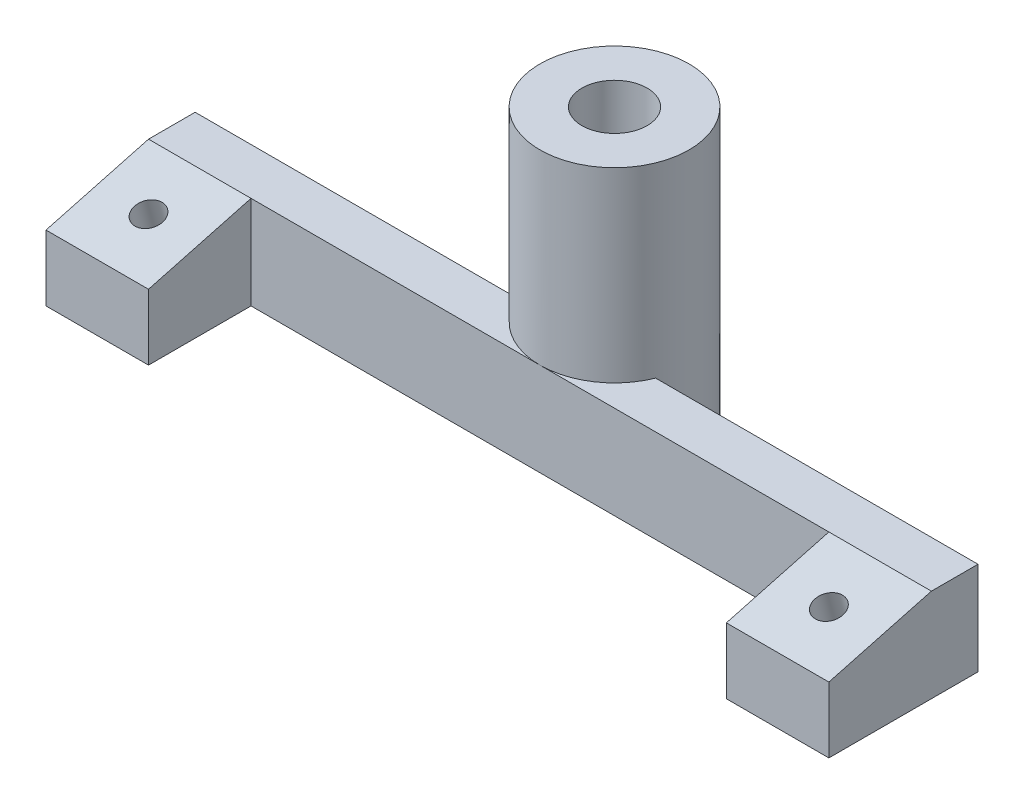
ISO-10303-21;
HEADER;
FILE_DESCRIPTION(('STEP AP214'),'2;1');
FILE_NAME('part.step','',(''),(''),'','','');
FILE_SCHEMA(('AUTOMOTIVE_DESIGN { 1 0 10303 214 1 1 1 1 }'));
ENDSEC;
DATA;
#1=APPLICATION_CONTEXT('core data for automotive mechanical design processes');
#2=APPLICATION_PROTOCOL_DEFINITION('international standard','automotive_design',2000,#1);
#3=PRODUCT_CONTEXT('',#1,'mechanical');
#4=PRODUCT('Part','Part','',(#3));
#5=PRODUCT_RELATED_PRODUCT_CATEGORY('part','',(#4));
#6=PRODUCT_DEFINITION_FORMATION('','',#4);
#7=PRODUCT_DEFINITION_CONTEXT('part definition',#1,'design');
#8=PRODUCT_DEFINITION('design','',#6,#7);
#9=PRODUCT_DEFINITION_SHAPE('','',#8);
#10=(LENGTH_UNIT() NAMED_UNIT(*) SI_UNIT(.MILLI.,.METRE.));
#11=(NAMED_UNIT(*) PLANE_ANGLE_UNIT() SI_UNIT($,.RADIAN.));
#12=(NAMED_UNIT(*) SI_UNIT($,.STERADIAN.) SOLID_ANGLE_UNIT());
#13=UNCERTAINTY_MEASURE_WITH_UNIT(LENGTH_MEASURE(1.E-05),#10,'distance_accuracy_value','');
#14=(GEOMETRIC_REPRESENTATION_CONTEXT(3) GLOBAL_UNCERTAINTY_ASSIGNED_CONTEXT((#13)) GLOBAL_UNIT_ASSIGNED_CONTEXT((#10,
#11,#12)) REPRESENTATION_CONTEXT('',''));
#15=CARTESIAN_POINT('',(0.,0.,0.));
#16=DIRECTION('',(0.,0.,1.));
#17=DIRECTION('',(1.,0.,0.));
#18=AXIS2_PLACEMENT_3D('',#15,#16,#17);
#19=CARTESIAN_POINT('',(0.,0.,-13.5));
#20=DIRECTION('',(0.,1.,0.));
#21=DIRECTION('',(0.,0.,1.));
#22=AXIS2_PLACEMENT_3D('',#19,#20,#21);
#23=CYLINDRICAL_SURFACE('',#22,3.5);
#24=CARTESIAN_POINT('',(0.,30.,-13.5));
#25=DIRECTION('',(0.,1.,0.));
#26=DIRECTION('',(0.,0.,1.));
#27=AXIS2_PLACEMENT_3D('',#24,#25,#26);
#28=CIRCLE('',#27,3.5);
#29=CARTESIAN_POINT('',(0.,30.,-10.));
#30=VERTEX_POINT('',#29);
#31=EDGE_CURVE('E145',#30,#30,#28,.T.);
#32=ORIENTED_EDGE('',*,*,#31,.T.);
#33=EDGE_LOOP('',(#32));
#34=FACE_BOUND('',#33,.T.);
#35=CARTESIAN_POINT('',(0.,24.,-13.5));
#36=DIRECTION('',(0.,-1.,0.));
#37=DIRECTION('',(0.,0.,-1.));
#38=AXIS2_PLACEMENT_3D('',#35,#36,#37);
#39=CIRCLE('',#38,3.5);
#40=CARTESIAN_POINT('',(0.,24.,-17.));
#41=VERTEX_POINT('',#40);
#42=EDGE_CURVE('E41',#41,#41,#39,.F.);
#43=ORIENTED_EDGE('',*,*,#42,.F.);
#44=EDGE_LOOP('',(#43));
#45=FACE_BOUND('',#44,.T.);
#46=ADVANCED_FACE('F37',(#34,#45),#23,.F.);
#47=CARTESIAN_POINT('',(-42.,10.,-10.5));
#48=DIRECTION('',(0.,0.,1.));
#49=DIRECTION('',(1.,0.,0.));
#50=AXIS2_PLACEMENT_3D('',#47,#48,#49);
#51=PLANE('',#50);
#52=DIRECTION('',(-1.,0.,0.));
#53=VECTOR('',#52,1.);
#54=CARTESIAN_POINT('',(-42.,10.,-10.5));
#55=LINE('',#54,#53);
#56=CARTESIAN_POINT('',(-7.41619848709566,10.,-10.5));
#57=VERTEX_POINT('',#56);
#58=CARTESIAN_POINT('',(-42.,10.,-10.5));
#59=VERTEX_POINT('',#58);
#60=EDGE_CURVE('E228',#57,#59,#55,.T.);
#61=ORIENTED_EDGE('',*,*,#60,.F.);
#62=DIRECTION('',(0.,-1.,0.));
#63=VECTOR('',#62,1.);
#64=CARTESIAN_POINT('',(-7.41619848709566,30.,-10.5));
#65=LINE('',#64,#63);
#66=CARTESIAN_POINT('',(-7.41619848709566,0.,-10.5));
#67=VERTEX_POINT('',#66);
#68=EDGE_CURVE('E54',#57,#67,#65,.T.);
#69=ORIENTED_EDGE('',*,*,#68,.T.);
#70=DIRECTION('',(-1.,0.,0.));
#71=VECTOR('',#70,1.);
#72=CARTESIAN_POINT('',(-42.,0.,-10.5));
#73=LINE('',#72,#71);
#74=CARTESIAN_POINT('',(-42.,0.,-10.5));
#75=VERTEX_POINT('',#74);
#76=EDGE_CURVE('E143',#67,#75,#73,.T.);
#77=ORIENTED_EDGE('',*,*,#76,.T.);
#78=DIRECTION('',(0.,-1.,0.));
#79=VECTOR('',#78,1.);
#80=CARTESIAN_POINT('',(-42.,10.,-10.5));
#81=LINE('',#80,#79);
#82=EDGE_CURVE('E183',#59,#75,#81,.T.);
#83=ORIENTED_EDGE('',*,*,#82,.F.);
#84=EDGE_LOOP('',(#61,#69,#77,#83));
#85=FACE_BOUND('',#84,.T.);
#86=ADVANCED_FACE('F270',(#85),#51,.F.);
#87=CARTESIAN_POINT('',(0.,10.,0.));
#88=DIRECTION('',(0.,-1.,0.));
#89=DIRECTION('',(0.,0.,-1.));
#90=AXIS2_PLACEMENT_3D('',#87,#88,#89);
#91=PLANE('',#90);
#92=CARTESIAN_POINT('',(42.,10.,-10.5));
#93=VERTEX_POINT('',#92);
#94=CARTESIAN_POINT('',(7.41619848709566,10.,-10.5));
#95=VERTEX_POINT('',#94);
#96=EDGE_CURVE('E229',#93,#95,#55,.T.);
#97=ORIENTED_EDGE('',*,*,#96,.T.);
#98=CARTESIAN_POINT('',(0.,10.,-13.5));
#99=DIRECTION('',(0.,-1.,0.));
#100=DIRECTION('',(0.,0.,-1.));
#101=AXIS2_PLACEMENT_3D('',#98,#99,#100);
#102=CIRCLE('',#101,8.);
#103=CARTESIAN_POINT('',(0.,10.,-5.5));
#104=VERTEX_POINT('',#103);
#105=EDGE_CURVE('E129',#95,#104,#102,.T.);
#106=ORIENTED_EDGE('',*,*,#105,.T.);
#107=DIRECTION('',(1.,0.,0.));
#108=VECTOR('',#107,1.);
#109=CARTESIAN_POINT('',(-31.,10.,-5.5));
#110=LINE('',#109,#108);
#111=CARTESIAN_POINT('',(31.,10.,-5.5));
#112=VERTEX_POINT('',#111);
#113=EDGE_CURVE('E234',#104,#112,#110,.T.);
#114=ORIENTED_EDGE('',*,*,#113,.T.);
#115=DIRECTION('',(-1.,0.,0.));
#116=VECTOR('',#115,1.);
#117=CARTESIAN_POINT('',(42.,10.,-5.5));
#118=LINE('',#117,#116);
#119=CARTESIAN_POINT('',(42.,10.,-5.5));
#120=VERTEX_POINT('',#119);
#121=EDGE_CURVE('E213',#120,#112,#118,.T.);
#122=ORIENTED_EDGE('',*,*,#121,.F.);
#123=DIRECTION('',(0.,0.,-1.));
#124=VECTOR('',#123,1.);
#125=CARTESIAN_POINT('',(42.,10.,-5.5));
#126=LINE('',#125,#124);
#127=EDGE_CURVE('E169',#120,#93,#126,.T.);
#128=ORIENTED_EDGE('',*,*,#127,.T.);
#129=EDGE_LOOP('',(#97,#106,#114,#122,#128));
#130=FACE_BOUND('',#129,.T.);
#131=ADVANCED_FACE('F300',(#130),#91,.F.);
#132=CARTESIAN_POINT('',(31.,10.,5.5));
#133=DIRECTION('',(0.,0.,-1.));
#134=DIRECTION('',(-1.,0.,0.));
#135=AXIS2_PLACEMENT_3D('',#132,#133,#134);
#136=PLANE('',#135);
#137=DIRECTION('',(0.,-1.,0.));
#138=VECTOR('',#137,1.);
#139=CARTESIAN_POINT('',(42.,10.,5.5));
#140=LINE('',#139,#138);
#141=CARTESIAN_POINT('',(42.,7.05255888325764,5.5));
#142=VERTEX_POINT('',#141);
#143=CARTESIAN_POINT('',(42.,0.,5.5));
#144=VERTEX_POINT('',#143);
#145=EDGE_CURVE('E46',#142,#144,#140,.T.);
#146=ORIENTED_EDGE('',*,*,#145,.F.);
#147=DIRECTION('',(-1.,0.,0.));
#148=VECTOR('',#147,1.);
#149=CARTESIAN_POINT('',(42.,7.05255888325764,5.5));
#150=LINE('',#149,#148);
#151=CARTESIAN_POINT('',(31.,7.05255888325764,5.5));
#152=VERTEX_POINT('',#151);
#153=EDGE_CURVE('E215',#142,#152,#150,.T.);
#154=ORIENTED_EDGE('',*,*,#153,.T.);
#155=DIRECTION('',(0.,-1.,0.));
#156=VECTOR('',#155,1.);
#157=CARTESIAN_POINT('',(31.,10.,5.5));
#158=LINE('',#157,#156);
#159=CARTESIAN_POINT('',(31.,0.,5.5));
#160=VERTEX_POINT('',#159);
#161=EDGE_CURVE('E170',#152,#160,#158,.T.);
#162=ORIENTED_EDGE('',*,*,#161,.T.);
#163=DIRECTION('',(1.,0.,0.));
#164=VECTOR('',#163,1.);
#165=CARTESIAN_POINT('',(31.,0.,5.5));
#166=LINE('',#165,#164);
#167=EDGE_CURVE('E226',#160,#144,#166,.T.);
#168=ORIENTED_EDGE('',*,*,#167,.T.);
#169=EDGE_LOOP('',(#146,#154,#162,#168));
#170=FACE_BOUND('',#169,.T.);
#171=ADVANCED_FACE('F39',(#170),#136,.F.);
#172=CARTESIAN_POINT('',(42.,10.,-10.5));
#173=DIRECTION('',(-1.,0.,0.));
#174=DIRECTION('',(0.,0.,1.));
#175=AXIS2_PLACEMENT_3D('',#172,#173,#174);
#176=PLANE('',#175);
#177=ORIENTED_EDGE('',*,*,#127,.F.);
#178=DIRECTION('',(0.,-0.258819045102521,0.965925826289068));
#179=VECTOR('',#178,1.);
#180=CARTESIAN_POINT('',(42.,10.,-5.5));
#181=LINE('',#180,#179);
#182=EDGE_CURVE('E62',#120,#142,#181,.T.);
#183=ORIENTED_EDGE('',*,*,#182,.T.);
#184=ORIENTED_EDGE('',*,*,#145,.T.);
#185=DIRECTION('',(0.,0.,-1.));
#186=VECTOR('',#185,1.);
#187=CARTESIAN_POINT('',(42.,0.,-10.5));
#188=LINE('',#187,#186);
#189=CARTESIAN_POINT('',(42.,0.,-10.5));
#190=VERTEX_POINT('',#189);
#191=EDGE_CURVE('E156',#144,#190,#188,.T.);
#192=ORIENTED_EDGE('',*,*,#191,.T.);
#193=DIRECTION('',(0.,-1.,0.));
#194=VECTOR('',#193,1.);
#195=CARTESIAN_POINT('',(42.,10.,-10.5));
#196=LINE('',#195,#194);
#197=EDGE_CURVE('E150',#93,#190,#196,.T.);
#198=ORIENTED_EDGE('',*,*,#197,.F.);
#199=EDGE_LOOP('',(#177,#183,#184,#192,#198));
#200=FACE_BOUND('',#199,.T.);
#201=ADVANCED_FACE('F242',(#200),#176,.F.);
#202=CARTESIAN_POINT('',(7.41619848709566,0.,-10.5));
#203=VERTEX_POINT('',#202);
#204=EDGE_CURVE('E141',#190,#203,#73,.T.);
#205=ORIENTED_EDGE('',*,*,#204,.T.);
#206=DIRECTION('',(0.,-1.,0.));
#207=VECTOR('',#206,1.);
#208=CARTESIAN_POINT('',(7.41619848709566,30.,-10.5));
#209=LINE('',#208,#207);
#210=EDGE_CURVE('E124',#203,#95,#209,.F.);
#211=ORIENTED_EDGE('',*,*,#210,.T.);
#212=ORIENTED_EDGE('',*,*,#96,.F.);
#213=ORIENTED_EDGE('',*,*,#197,.T.);
#214=EDGE_LOOP('',(#205,#211,#212,#213));
#215=FACE_BOUND('',#214,.T.);
#216=ADVANCED_FACE('F148',(#215),#51,.F.);
#217=CARTESIAN_POINT('',(-42.,10.,-5.5));
#218=DIRECTION('',(1.,0.,0.));
#219=DIRECTION('',(0.,0.,-1.));
#220=AXIS2_PLACEMENT_3D('',#217,#218,#219);
#221=PLANE('',#220);
#222=DIRECTION('',(0.,-1.,0.));
#223=VECTOR('',#222,1.);
#224=CARTESIAN_POINT('',(-42.,10.,5.5));
#225=LINE('',#224,#223);
#226=CARTESIAN_POINT('',(-42.,7.05255888325764,5.5));
#227=VERTEX_POINT('',#226);
#228=CARTESIAN_POINT('',(-42.,0.,5.5));
#229=VERTEX_POINT('',#228);
#230=EDGE_CURVE('E181',#227,#229,#225,.T.);
#231=ORIENTED_EDGE('',*,*,#230,.F.);
#232=DIRECTION('',(0.,-0.258819045102521,0.965925826289068));
#233=VECTOR('',#232,1.);
#234=CARTESIAN_POINT('',(-42.,10.,-5.5));
#235=LINE('',#234,#233);
#236=CARTESIAN_POINT('',(-42.,10.,-5.5));
#237=VERTEX_POINT('',#236);
#238=EDGE_CURVE('E208',#237,#227,#235,.T.);
#239=ORIENTED_EDGE('',*,*,#238,.F.);
#240=DIRECTION('',(0.,0.,1.));
#241=VECTOR('',#240,1.);
#242=CARTESIAN_POINT('',(-42.,10.,-5.5));
#243=LINE('',#242,#241);
#244=EDGE_CURVE('E231',#59,#237,#243,.T.);
#245=ORIENTED_EDGE('',*,*,#244,.F.);
#246=ORIENTED_EDGE('',*,*,#82,.T.);
#247=DIRECTION('',(0.,0.,1.));
#248=VECTOR('',#247,1.);
#249=CARTESIAN_POINT('',(-42.,0.,-5.5));
#250=LINE('',#249,#248);
#251=EDGE_CURVE('E151',#75,#229,#250,.T.);
#252=ORIENTED_EDGE('',*,*,#251,.T.);
#253=EDGE_LOOP('',(#231,#239,#245,#246,#252));
#254=FACE_BOUND('',#253,.T.);
#255=ADVANCED_FACE('F265',(#254),#221,.F.);
#256=CARTESIAN_POINT('',(-42.,10.,5.5));
#257=DIRECTION('',(0.,0.,-1.));
#258=DIRECTION('',(-1.,0.,0.));
#259=AXIS2_PLACEMENT_3D('',#256,#257,#258);
#260=PLANE('',#259);
#261=DIRECTION('',(0.,-1.,0.));
#262=VECTOR('',#261,1.);
#263=CARTESIAN_POINT('',(-31.,10.,5.5));
#264=LINE('',#263,#262);
#265=CARTESIAN_POINT('',(-31.,7.05255888325764,5.5));
#266=VERTEX_POINT('',#265);
#267=CARTESIAN_POINT('',(-31.,0.,5.5));
#268=VERTEX_POINT('',#267);
#269=EDGE_CURVE('E179',#266,#268,#264,.T.);
#270=ORIENTED_EDGE('',*,*,#269,.F.);
#271=EDGE_CURVE('E219',#266,#227,#150,.T.);
#272=ORIENTED_EDGE('',*,*,#271,.T.);
#273=ORIENTED_EDGE('',*,*,#230,.T.);
#274=DIRECTION('',(1.,0.,0.));
#275=VECTOR('',#274,1.);
#276=CARTESIAN_POINT('',(-42.,0.,5.5));
#277=LINE('',#276,#275);
#278=EDGE_CURVE('E154',#229,#268,#277,.T.);
#279=ORIENTED_EDGE('',*,*,#278,.T.);
#280=EDGE_LOOP('',(#270,#272,#273,#279));
#281=FACE_BOUND('',#280,.T.);
#282=ADVANCED_FACE('F260',(#281),#260,.F.);
#283=CARTESIAN_POINT('',(-31.,10.,-5.5));
#284=DIRECTION('',(-1.,0.,0.));
#285=DIRECTION('',(0.,0.,1.));
#286=AXIS2_PLACEMENT_3D('',#283,#284,#285);
#287=PLANE('',#286);
#288=DIRECTION('',(0.,-1.,0.));
#289=VECTOR('',#288,1.);
#290=CARTESIAN_POINT('',(-31.,10.,-5.5));
#291=LINE('',#290,#289);
#292=CARTESIAN_POINT('',(-31.,10.,-5.5));
#293=VERTEX_POINT('',#292);
#294=CARTESIAN_POINT('',(-31.,0.,-5.5));
#295=VERTEX_POINT('',#294);
#296=EDGE_CURVE('E176',#293,#295,#291,.T.);
#297=ORIENTED_EDGE('',*,*,#296,.F.);
#298=DIRECTION('',(0.,-0.258819045102521,0.965925826289068));
#299=VECTOR('',#298,1.);
#300=CARTESIAN_POINT('',(-31.,10.,-5.5));
#301=LINE('',#300,#299);
#302=EDGE_CURVE('E223',#293,#266,#301,.T.);
#303=ORIENTED_EDGE('',*,*,#302,.T.);
#304=ORIENTED_EDGE('',*,*,#269,.T.);
#305=DIRECTION('',(0.,0.,-1.));
#306=VECTOR('',#305,1.);
#307=CARTESIAN_POINT('',(-31.,0.,-5.5));
#308=LINE('',#307,#306);
#309=EDGE_CURVE('E162',#268,#295,#308,.T.);
#310=ORIENTED_EDGE('',*,*,#309,.T.);
#311=EDGE_LOOP('',(#297,#303,#304,#310));
#312=FACE_BOUND('',#311,.T.);
#313=ADVANCED_FACE('F256',(#312),#287,.F.);
#314=CARTESIAN_POINT('',(-31.,10.,-5.5));
#315=DIRECTION('',(0.,0.,-1.));
#316=DIRECTION('',(-1.,0.,0.));
#317=AXIS2_PLACEMENT_3D('',#314,#315,#316);
#318=PLANE('',#317);
#319=ORIENTED_EDGE('',*,*,#113,.F.);
#320=EDGE_CURVE('E173',#293,#104,#110,.T.);
#321=ORIENTED_EDGE('',*,*,#320,.F.);
#322=ORIENTED_EDGE('',*,*,#296,.T.);
#323=DIRECTION('',(1.,0.,0.));
#324=VECTOR('',#323,1.);
#325=CARTESIAN_POINT('',(-31.,0.,-5.5));
#326=LINE('',#325,#324);
#327=CARTESIAN_POINT('',(31.,0.,-5.5));
#328=VERTEX_POINT('',#327);
#329=EDGE_CURVE('E164',#295,#328,#326,.T.);
#330=ORIENTED_EDGE('',*,*,#329,.T.);
#331=DIRECTION('',(0.,-1.,0.));
#332=VECTOR('',#331,1.);
#333=CARTESIAN_POINT('',(31.,10.,-5.5));
#334=LINE('',#333,#332);
#335=EDGE_CURVE('E172',#112,#328,#334,.T.);
#336=ORIENTED_EDGE('',*,*,#335,.F.);
#337=EDGE_LOOP('',(#319,#321,#322,#330,#336));
#338=FACE_BOUND('',#337,.T.);
#339=ADVANCED_FACE('F252',(#338),#318,.F.);
#340=CARTESIAN_POINT('',(31.,10.,-5.5));
#341=DIRECTION('',(1.,0.,0.));
#342=DIRECTION('',(0.,0.,-1.));
#343=AXIS2_PLACEMENT_3D('',#340,#341,#342);
#344=PLANE('',#343);
#345=ORIENTED_EDGE('',*,*,#161,.F.);
#346=DIRECTION('',(0.,0.258819045102521,-0.965925826289068));
#347=VECTOR('',#346,1.);
#348=CARTESIAN_POINT('',(31.,10.,-5.5));
#349=LINE('',#348,#347);
#350=EDGE_CURVE('E218',#152,#112,#349,.T.);
#351=ORIENTED_EDGE('',*,*,#350,.T.);
#352=ORIENTED_EDGE('',*,*,#335,.T.);
#353=DIRECTION('',(0.,0.,1.));
#354=VECTOR('',#353,1.);
#355=CARTESIAN_POINT('',(31.,0.,-5.5));
#356=LINE('',#355,#354);
#357=EDGE_CURVE('E166',#328,#160,#356,.T.);
#358=ORIENTED_EDGE('',*,*,#357,.T.);
#359=EDGE_LOOP('',(#345,#351,#352,#358));
#360=FACE_BOUND('',#359,.T.);
#361=ADVANCED_FACE('F248',(#360),#344,.F.);
#362=ORIENTED_EDGE('',*,*,#320,.T.);
#363=EDGE_CURVE('E319',#104,#57,#102,.T.);
#364=ORIENTED_EDGE('',*,*,#363,.T.);
#365=ORIENTED_EDGE('',*,*,#60,.T.);
#366=ORIENTED_EDGE('',*,*,#244,.T.);
#367=DIRECTION('',(1.,0.,0.));
#368=VECTOR('',#367,1.);
#369=CARTESIAN_POINT('',(0.,10.,-5.5));
#370=LINE('',#369,#368);
#371=EDGE_CURVE('E11',#237,#293,#370,.T.);
#372=ORIENTED_EDGE('',*,*,#371,.T.);
#373=EDGE_LOOP('',(#362,#364,#365,#366,#372));
#374=FACE_BOUND('',#373,.T.);
#375=ADVANCED_FACE('F339',(#374),#91,.F.);
#376=CARTESIAN_POINT('',(0.,0.,0.));
#377=DIRECTION('',(0.,-1.,0.));
#378=DIRECTION('',(0.,0.,-1.));
#379=AXIS2_PLACEMENT_3D('',#376,#377,#378);
#380=PLANE('',#379);
#381=CARTESIAN_POINT('',(0.,0.,-13.5));
#382=DIRECTION('',(0.,-1.,0.));
#383=DIRECTION('',(0.,0.,-1.));
#384=AXIS2_PLACEMENT_3D('',#381,#382,#383);
#385=CIRCLE('',#384,5.25);
#386=CARTESIAN_POINT('',(0.,0.,-18.75));
#387=VERTEX_POINT('',#386);
#388=EDGE_CURVE('E323',#387,#387,#385,.T.);
#389=ORIENTED_EDGE('',*,*,#388,.F.);
#390=EDGE_LOOP('',(#389));
#391=FACE_BOUND('',#390,.T.);
#392=ORIENTED_EDGE('',*,*,#76,.F.);
#393=CARTESIAN_POINT('',(0.,0.,-13.5));
#394=DIRECTION('',(0.,-1.,0.));
#395=DIRECTION('',(0.,0.,-1.));
#396=AXIS2_PLACEMENT_3D('',#393,#394,#395);
#397=CIRCLE('',#396,8.);
#398=EDGE_CURVE('E127',#67,#203,#397,.T.);
#399=ORIENTED_EDGE('',*,*,#398,.T.);
#400=ORIENTED_EDGE('',*,*,#204,.F.);
#401=ORIENTED_EDGE('',*,*,#191,.F.);
#402=ORIENTED_EDGE('',*,*,#167,.F.);
#403=ORIENTED_EDGE('',*,*,#357,.F.);
#404=ORIENTED_EDGE('',*,*,#329,.F.);
#405=ORIENTED_EDGE('',*,*,#309,.F.);
#406=ORIENTED_EDGE('',*,*,#278,.F.);
#407=ORIENTED_EDGE('',*,*,#251,.F.);
#408=EDGE_LOOP('',(#392,#399,#400,#401,#402,#403,#404,#405,#406,#407));
#409=FACE_BOUND('',#408,.T.);
#410=CARTESIAN_POINT('',(-36.5,0.,-2.28460969082653));
#411=DIRECTION('',(0.,-1.,0.));
#412=DIRECTION('',(0.,0.,1.));
#413=AXIS2_PLACEMENT_3D('',#410,#411,#412);
#414=ELLIPSE('',#413,3.36464758633277,3.25);
#415=CARTESIAN_POINT('',(-36.5,0.,1.08003789550624));
#416=VERTEX_POINT('',#415);
#417=EDGE_CURVE('E197',#416,#416,#414,.T.);
#418=ORIENTED_EDGE('',*,*,#417,.F.);
#419=EDGE_LOOP('',(#418));
#420=FACE_BOUND('',#419,.T.);
#421=CARTESIAN_POINT('',(36.5,0.,-2.28460969082653));
#422=DIRECTION('',(0.,-1.,0.));
#423=DIRECTION('',(0.,0.,1.));
#424=AXIS2_PLACEMENT_3D('',#421,#422,#423);
#425=ELLIPSE('',#424,3.36464758633277,3.25);
#426=CARTESIAN_POINT('',(36.5,0.,1.08003789550624));
#427=VERTEX_POINT('',#426);
#428=EDGE_CURVE('E195',#427,#427,#425,.T.);
#429=ORIENTED_EDGE('',*,*,#428,.F.);
#430=EDGE_LOOP('',(#429));
#431=FACE_BOUND('',#430,.T.);
#432=ADVANCED_FACE('F138',(#391,#409,#420,#431),#380,.T.);
#433=CARTESIAN_POINT('',(42.,10.,-5.5));
#434=DIRECTION('',(0.,-0.965925826289068,-0.258819045102521));
#435=DIRECTION('',(0.,0.258819045102521,-0.965925826289068));
#436=AXIS2_PLACEMENT_3D('',#433,#434,#435);
#437=PLANE('',#436);
#438=CARTESIAN_POINT('',(36.5,8.52627944162882,0.));
#439=DIRECTION('',(0.,-0.965925826289068,-0.258819045102521));
#440=DIRECTION('',(0.,0.258819045102521,-0.965925826289068));
#441=AXIS2_PLACEMENT_3D('',#438,#439,#440);
#442=CIRCLE('',#441,1.5);
#443=CARTESIAN_POINT('',(36.5,8.9145080092826,-1.4488887394336));
#444=VERTEX_POINT('',#443);
#445=EDGE_CURVE('E199',#444,#444,#442,.T.);
#446=ORIENTED_EDGE('',*,*,#445,.T.);
#447=EDGE_LOOP('',(#446));
#448=FACE_BOUND('',#447,.T.);
#449=ORIENTED_EDGE('',*,*,#153,.F.);
#450=ORIENTED_EDGE('',*,*,#182,.F.);
#451=ORIENTED_EDGE('',*,*,#121,.T.);
#452=ORIENTED_EDGE('',*,*,#350,.F.);
#453=EDGE_LOOP('',(#449,#450,#451,#452));
#454=FACE_BOUND('',#453,.T.);
#455=ADVANCED_FACE('F338',(#448,#454),#437,.F.);
#456=CARTESIAN_POINT('',(-36.5,8.52627944162882,0.));
#457=DIRECTION('',(0.,-0.965925826289068,-0.258819045102521));
#458=DIRECTION('',(0.,0.258819045102521,-0.965925826289068));
#459=AXIS2_PLACEMENT_3D('',#456,#457,#458);
#460=CIRCLE('',#459,1.5);
#461=CARTESIAN_POINT('',(-36.5,8.9145080092826,-1.4488887394336));
#462=VERTEX_POINT('',#461);
#463=EDGE_CURVE('E203',#462,#462,#460,.T.);
#464=ORIENTED_EDGE('',*,*,#463,.T.);
#465=EDGE_LOOP('',(#464));
#466=FACE_BOUND('',#465,.T.);
#467=ORIENTED_EDGE('',*,*,#371,.F.);
#468=ORIENTED_EDGE('',*,*,#238,.T.);
#469=ORIENTED_EDGE('',*,*,#271,.F.);
#470=ORIENTED_EDGE('',*,*,#302,.F.);
#471=EDGE_LOOP('',(#467,#468,#469,#470));
#472=FACE_BOUND('',#471,.T.);
#473=ADVANCED_FACE('F345',(#466,#472),#437,.F.);
#474=CARTESIAN_POINT('',(-36.5,-2.05384757729337,-2.83493649053891));
#475=DIRECTION('',(0.,0.965925826289068,0.258819045102521));
#476=DIRECTION('',(0.,-0.258819045102521,0.965925826289068));
#477=AXIS2_PLACEMENT_3D('',#474,#475,#476);
#478=CYLINDRICAL_SURFACE('',#477,1.5);
#479=CARTESIAN_POINT('',(-36.5,4.66257613647255,-1.03527618041008));
#480=DIRECTION('',(0.,0.965925826289068,0.258819045102521));
#481=DIRECTION('',(0.,-0.258819045102521,0.965925826289068));
#482=AXIS2_PLACEMENT_3D('',#479,#480,#481);
#483=CIRCLE('',#482,1.5);
#484=CARTESIAN_POINT('',(-36.5,4.27434756881877,0.413612559023525));
#485=VERTEX_POINT('',#484);
#486=EDGE_CURVE('E191',#485,#485,#483,.T.);
#487=ORIENTED_EDGE('',*,*,#486,.F.);
#488=EDGE_LOOP('',(#487));
#489=FACE_BOUND('',#488,.T.);
#490=ORIENTED_EDGE('',*,*,#463,.F.);
#491=EDGE_LOOP('',(#490));
#492=FACE_BOUND('',#491,.T.);
#493=ADVANCED_FACE('F415',(#489,#492),#478,.F.);
#494=CARTESIAN_POINT('',(36.5,-2.05384757729337,-2.83493649053891));
#495=DIRECTION('',(0.,0.965925826289068,0.258819045102521));
#496=DIRECTION('',(0.,-0.258819045102521,0.965925826289068));
#497=AXIS2_PLACEMENT_3D('',#494,#495,#496);
#498=CYLINDRICAL_SURFACE('',#497,1.5);
#499=CARTESIAN_POINT('',(36.5,4.66257613647255,-1.03527618041008));
#500=DIRECTION('',(0.,0.965925826289068,0.258819045102521));
#501=DIRECTION('',(0.,-0.258819045102521,0.965925826289068));
#502=AXIS2_PLACEMENT_3D('',#499,#500,#501);
#503=CIRCLE('',#502,1.5);
#504=CARTESIAN_POINT('',(36.5,4.27434756881877,0.413612559023525));
#505=VERTEX_POINT('',#504);
#506=EDGE_CURVE('E188',#505,#505,#503,.T.);
#507=ORIENTED_EDGE('',*,*,#506,.F.);
#508=EDGE_LOOP('',(#507));
#509=FACE_BOUND('',#508,.T.);
#510=ORIENTED_EDGE('',*,*,#445,.F.);
#511=EDGE_LOOP('',(#510));
#512=FACE_BOUND('',#511,.T.);
#513=ADVANCED_FACE('F405',(#509,#512),#498,.F.);
#514=CARTESIAN_POINT('',(36.5,-2.05384757729337,-2.83493649053891));
#515=DIRECTION('',(0.,0.965925826289068,0.258819045102521));
#516=DIRECTION('',(0.,-0.258819045102521,0.965925826289068));
#517=AXIS2_PLACEMENT_3D('',#514,#515,#516);
#518=CYLINDRICAL_SURFACE('',#517,3.25);
#519=ORIENTED_EDGE('',*,*,#428,.T.);
#520=EDGE_LOOP('',(#519));
#521=FACE_BOUND('',#520,.T.);
#522=CARTESIAN_POINT('',(36.5,4.66257613647255,-1.03527618041008));
#523=DIRECTION('',(0.,0.965925826289068,0.258819045102521));
#524=DIRECTION('',(0.,-0.258819045102521,0.965925826289068));
#525=AXIS2_PLACEMENT_3D('',#522,#523,#524);
#526=CIRCLE('',#525,3.25);
#527=CARTESIAN_POINT('',(36.5,3.82141423988936,2.10398275502939));
#528=VERTEX_POINT('',#527);
#529=EDGE_CURVE('E271',#528,#528,#526,.T.);
#530=ORIENTED_EDGE('',*,*,#529,.T.);
#531=EDGE_LOOP('',(#530));
#532=FACE_BOUND('',#531,.T.);
#533=ADVANCED_FACE('F395',(#521,#532),#518,.F.);
#534=CARTESIAN_POINT('',(36.5,4.66257613647255,-1.03527618041008));
#535=DIRECTION('',(0.,0.965925826289068,0.258819045102521));
#536=DIRECTION('',(0.,-0.258819045102521,0.965925826289068));
#537=AXIS2_PLACEMENT_3D('',#534,#535,#536);
#538=PLANE('',#537);
#539=ORIENTED_EDGE('',*,*,#506,.T.);
#540=EDGE_LOOP('',(#539));
#541=FACE_BOUND('',#540,.T.);
#542=ORIENTED_EDGE('',*,*,#529,.F.);
#543=EDGE_LOOP('',(#542));
#544=FACE_BOUND('',#543,.T.);
#545=ADVANCED_FACE('F292',(#541,#544),#538,.F.);
#546=CARTESIAN_POINT('',(-36.5,-2.05384757729337,-2.83493649053891));
#547=DIRECTION('',(0.,0.965925826289068,0.258819045102521));
#548=DIRECTION('',(0.,-0.258819045102521,0.965925826289068));
#549=AXIS2_PLACEMENT_3D('',#546,#547,#548);
#550=CYLINDRICAL_SURFACE('',#549,3.25);
#551=ORIENTED_EDGE('',*,*,#417,.T.);
#552=EDGE_LOOP('',(#551));
#553=FACE_BOUND('',#552,.T.);
#554=CARTESIAN_POINT('',(-36.5,4.66257613647255,-1.03527618041008));
#555=DIRECTION('',(0.,0.965925826289068,0.258819045102521));
#556=DIRECTION('',(0.,-0.258819045102521,0.965925826289068));
#557=AXIS2_PLACEMENT_3D('',#554,#555,#556);
#558=CIRCLE('',#557,3.25);
#559=CARTESIAN_POINT('',(-36.5,3.82141423988936,2.10398275502939));
#560=VERTEX_POINT('',#559);
#561=EDGE_CURVE('E192',#560,#560,#558,.T.);
#562=ORIENTED_EDGE('',*,*,#561,.T.);
#563=EDGE_LOOP('',(#562));
#564=FACE_BOUND('',#563,.T.);
#565=ADVANCED_FACE('F279',(#553,#564),#550,.F.);
#566=CARTESIAN_POINT('',(-36.5,4.66257613647255,-1.03527618041008));
#567=DIRECTION('',(0.,0.965925826289068,0.258819045102521));
#568=DIRECTION('',(0.,-0.258819045102521,0.965925826289068));
#569=AXIS2_PLACEMENT_3D('',#566,#567,#568);
#570=PLANE('',#569);
#571=ORIENTED_EDGE('',*,*,#486,.T.);
#572=EDGE_LOOP('',(#571));
#573=FACE_BOUND('',#572,.T.);
#574=ORIENTED_EDGE('',*,*,#561,.F.);
#575=EDGE_LOOP('',(#574));
#576=FACE_BOUND('',#575,.T.);
#577=ADVANCED_FACE('F281',(#573,#576),#570,.F.);
#578=CARTESIAN_POINT('',(0.,30.,-13.5));
#579=DIRECTION('',(0.,-1.,0.));
#580=DIRECTION('',(0.,0.,-1.));
#581=AXIS2_PLACEMENT_3D('',#578,#579,#580);
#582=CYLINDRICAL_SURFACE('',#581,8.);
#583=CARTESIAN_POINT('',(0.,30.,-13.5));
#584=DIRECTION('',(0.,-1.,0.));
#585=DIRECTION('',(0.,0.,-1.));
#586=AXIS2_PLACEMENT_3D('',#583,#584,#585);
#587=CIRCLE('',#586,8.);
#588=CARTESIAN_POINT('',(0.,30.,-21.5));
#589=VERTEX_POINT('',#588);
#590=EDGE_CURVE('E144',#589,#589,#587,.T.);
#591=ORIENTED_EDGE('',*,*,#590,.T.);
#592=EDGE_LOOP('',(#591));
#593=FACE_BOUND('',#592,.T.);
#594=ORIENTED_EDGE('',*,*,#68,.F.);
#595=ORIENTED_EDGE('',*,*,#363,.F.);
#596=ORIENTED_EDGE('',*,*,#105,.F.);
#597=ORIENTED_EDGE('',*,*,#210,.F.);
#598=ORIENTED_EDGE('',*,*,#398,.F.);
#599=EDGE_LOOP('',(#594,#595,#596,#597,#598));
#600=FACE_BOUND('',#599,.T.);
#601=ADVANCED_FACE('F126',(#593,#600),#582,.T.);
#602=CARTESIAN_POINT('',(0.,30.,-13.5));
#603=DIRECTION('',(0.,-1.,0.));
#604=DIRECTION('',(0.,0.,-1.));
#605=AXIS2_PLACEMENT_3D('',#602,#603,#604);
#606=PLANE('',#605);
#607=ORIENTED_EDGE('',*,*,#31,.F.);
#608=EDGE_LOOP('',(#607));
#609=FACE_BOUND('',#608,.T.);
#610=ORIENTED_EDGE('',*,*,#590,.F.);
#611=EDGE_LOOP('',(#610));
#612=FACE_BOUND('',#611,.T.);
#613=ADVANCED_FACE('F289',(#609,#612),#606,.F.);
#614=CARTESIAN_POINT('',(0.,24.,-13.5));
#615=DIRECTION('',(0.,-1.,0.));
#616=DIRECTION('',(0.,0.,-1.));
#617=AXIS2_PLACEMENT_3D('',#614,#615,#616);
#618=PLANE('',#617);
#619=CARTESIAN_POINT('',(0.,24.,-13.5));
#620=DIRECTION('',(0.,-1.,0.));
#621=DIRECTION('',(0.,0.,-1.));
#622=AXIS2_PLACEMENT_3D('',#619,#620,#621);
#623=CIRCLE('',#622,5.25);
#624=CARTESIAN_POINT('',(0.,24.,-18.75));
#625=VERTEX_POINT('',#624);
#626=EDGE_CURVE('E326',#625,#625,#623,.T.);
#627=ORIENTED_EDGE('',*,*,#626,.T.);
#628=EDGE_LOOP('',(#627));
#629=FACE_BOUND('',#628,.T.);
#630=ORIENTED_EDGE('',*,*,#42,.T.);
#631=EDGE_LOOP('',(#630));
#632=FACE_BOUND('',#631,.T.);
#633=ADVANCED_FACE('F309',(#629,#632),#618,.T.);
#634=CARTESIAN_POINT('',(0.,24.,-13.5));
#635=DIRECTION('',(0.,-1.,0.));
#636=DIRECTION('',(0.,0.,-1.));
#637=AXIS2_PLACEMENT_3D('',#634,#635,#636);
#638=CYLINDRICAL_SURFACE('',#637,5.25);
#639=ORIENTED_EDGE('',*,*,#626,.F.);
#640=EDGE_LOOP('',(#639));
#641=FACE_BOUND('',#640,.T.);
#642=ORIENTED_EDGE('',*,*,#388,.T.);
#643=EDGE_LOOP('',(#642));
#644=FACE_BOUND('',#643,.T.);
#645=ADVANCED_FACE('F306',(#641,#644),#638,.F.);
#646=CLOSED_SHELL('',(#46,#86,#131,#171,#201,#216,#255,#282,#313,#339,#361,#375,#432,#455,#473,
#493,#513,#533,#545,#565,#577,#601,#613,#633,#645));
#647=MANIFOLD_SOLID_BREP('B2',#646);
#648=ADVANCED_BREP_SHAPE_REPRESENTATION('',(#18,#647),#14);
#649=SHAPE_DEFINITION_REPRESENTATION(#9,#648);
ENDSEC;
END-ISO-10303-21;
